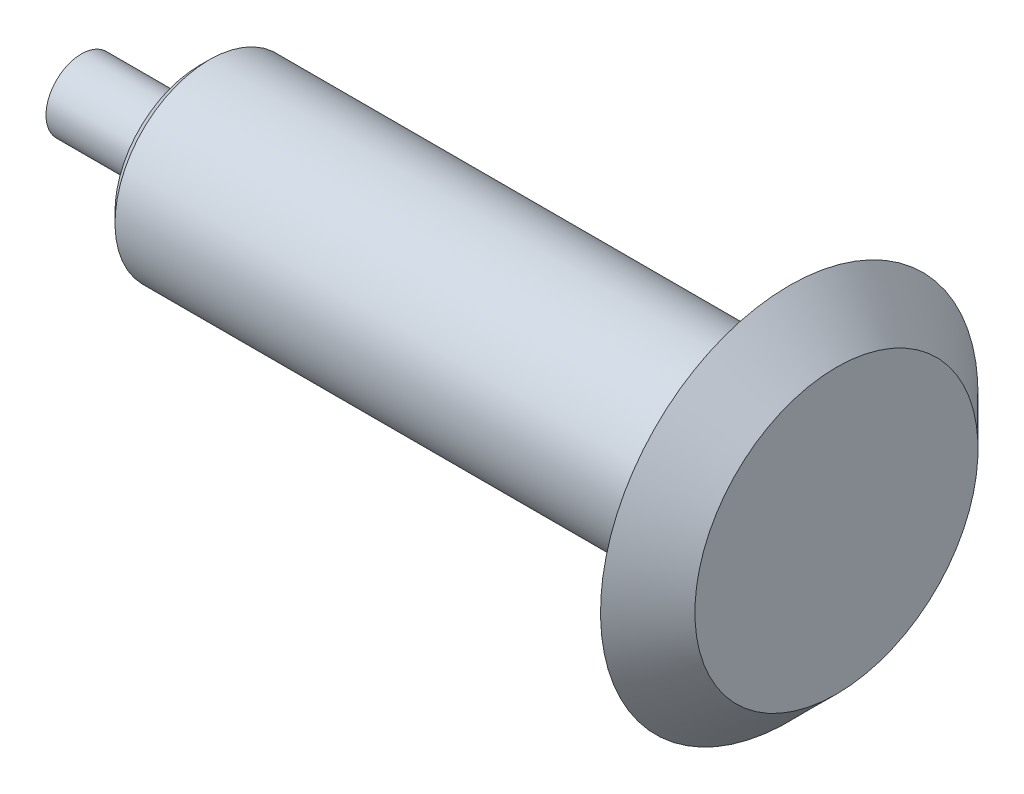
ISO-10303-21;
HEADER;
FILE_DESCRIPTION(('STEP AP214'),'2;1');
FILE_NAME('part.step','',(''),(''),'','','');
FILE_SCHEMA(('AUTOMOTIVE_DESIGN { 1 0 10303 214 1 1 1 1 }'));
ENDSEC;
DATA;
#1=APPLICATION_CONTEXT('core data for automotive mechanical design processes');
#2=APPLICATION_PROTOCOL_DEFINITION('international standard','automotive_design',2000,#1);
#3=PRODUCT_CONTEXT('',#1,'mechanical');
#4=PRODUCT('Part','Part','',(#3));
#5=PRODUCT_RELATED_PRODUCT_CATEGORY('part','',(#4));
#6=PRODUCT_DEFINITION_FORMATION('','',#4);
#7=PRODUCT_DEFINITION_CONTEXT('part definition',#1,'design');
#8=PRODUCT_DEFINITION('design','',#6,#7);
#9=PRODUCT_DEFINITION_SHAPE('','',#8);
#10=(LENGTH_UNIT() NAMED_UNIT(*) SI_UNIT(.MILLI.,.METRE.));
#11=(NAMED_UNIT(*) PLANE_ANGLE_UNIT() SI_UNIT($,.RADIAN.));
#12=(NAMED_UNIT(*) SI_UNIT($,.STERADIAN.) SOLID_ANGLE_UNIT());
#13=UNCERTAINTY_MEASURE_WITH_UNIT(LENGTH_MEASURE(1.E-05),#10,'distance_accuracy_value','');
#14=(GEOMETRIC_REPRESENTATION_CONTEXT(3) GLOBAL_UNCERTAINTY_ASSIGNED_CONTEXT((#13)) GLOBAL_UNIT_ASSIGNED_CONTEXT((#10,
#11,#12)) REPRESENTATION_CONTEXT('',''));
#15=CARTESIAN_POINT('',(0.,0.,0.));
#16=DIRECTION('',(0.,0.,1.));
#17=DIRECTION('',(1.,0.,0.));
#18=AXIS2_PLACEMENT_3D('',#15,#16,#17);
#19=CARTESIAN_POINT('',(0.,0.,0.));
#20=DIRECTION('',(-1.,0.,0.));
#21=DIRECTION('',(0.,-1.,0.));
#22=AXIS2_PLACEMENT_3D('',#19,#20,#21);
#23=PLANE('',#22);
#24=CARTESIAN_POINT('',(0.,0.,0.));
#25=DIRECTION('',(1.,0.,0.));
#26=DIRECTION('',(0.,1.,0.));
#27=AXIS2_PLACEMENT_3D('',#24,#25,#26);
#28=CIRCLE('',#27,7.5);
#29=CARTESIAN_POINT('',(0.,7.5,0.));
#30=VERTEX_POINT('',#29);
#31=EDGE_CURVE('E10',#30,#30,#28,.T.);
#32=ORIENTED_EDGE('',*,*,#31,.F.);
#33=EDGE_LOOP('',(#32));
#34=FACE_BOUND('',#33,.T.);
#35=ADVANCED_FACE('F39',(#34),#23,.T.);
#36=CARTESIAN_POINT('',(160.,0.,0.));
#37=DIRECTION('',(1.,0.,0.));
#38=DIRECTION('',(0.,1.,0.));
#39=AXIS2_PLACEMENT_3D('',#36,#37,#38);
#40=CYLINDRICAL_SURFACE('',#39,7.5);
#41=ORIENTED_EDGE('',*,*,#31,.T.);
#42=EDGE_LOOP('',(#41));
#43=FACE_BOUND('',#42,.T.);
#44=CARTESIAN_POINT('',(25.,0.,0.));
#45=DIRECTION('',(1.,0.,0.));
#46=DIRECTION('',(0.,1.,0.));
#47=AXIS2_PLACEMENT_3D('',#44,#45,#46);
#48=CIRCLE('',#47,7.5);
#49=CARTESIAN_POINT('',(25.,7.5,0.));
#50=VERTEX_POINT('',#49);
#51=EDGE_CURVE('E46',#50,#50,#48,.T.);
#52=ORIENTED_EDGE('',*,*,#51,.F.);
#53=EDGE_LOOP('',(#52));
#54=FACE_BOUND('',#53,.T.);
#55=ADVANCED_FACE('F95',(#43,#54),#40,.T.);
#56=CARTESIAN_POINT('',(25.,7.5,0.));
#57=DIRECTION('',(-1.,0.,0.));
#58=DIRECTION('',(0.,-1.,0.));
#59=AXIS2_PLACEMENT_3D('',#56,#57,#58);
#60=PLANE('',#59);
#61=ORIENTED_EDGE('',*,*,#51,.T.);
#62=EDGE_LOOP('',(#61));
#63=FACE_BOUND('',#62,.T.);
#64=CARTESIAN_POINT('',(25.,0.,0.));
#65=DIRECTION('',(1.,0.,0.));
#66=DIRECTION('',(0.,1.,0.));
#67=AXIS2_PLACEMENT_3D('',#64,#65,#66);
#68=CIRCLE('',#67,17.8786796564404);
#69=CARTESIAN_POINT('',(25.,17.8786796564404,0.));
#70=VERTEX_POINT('',#69);
#71=EDGE_CURVE('E51',#70,#70,#68,.T.);
#72=ORIENTED_EDGE('',*,*,#71,.F.);
#73=EDGE_LOOP('',(#72));
#74=FACE_BOUND('',#73,.T.);
#75=ADVANCED_FACE('F100',(#63,#74),#60,.T.);
#76=CARTESIAN_POINT('',(27.1213203435597,0.,0.));
#77=DIRECTION('',(1.,0.,0.));
#78=DIRECTION('',(0.,1.,0.));
#79=AXIS2_PLACEMENT_3D('',#76,#77,#78);
#80=CONICAL_SURFACE('',#79,20.,0.78539816339744);
#81=ORIENTED_EDGE('',*,*,#71,.T.);
#82=EDGE_LOOP('',(#81));
#83=FACE_BOUND('',#82,.T.);
#84=CARTESIAN_POINT('',(27.1213203435597,0.,0.));
#85=DIRECTION('',(1.,0.,0.));
#86=DIRECTION('',(0.,1.,0.));
#87=AXIS2_PLACEMENT_3D('',#84,#85,#86);
#88=CIRCLE('',#87,20.);
#89=CARTESIAN_POINT('',(27.1213203435597,20.,0.));
#90=VERTEX_POINT('',#89);
#91=EDGE_CURVE('E56',#90,#90,#88,.T.);
#92=ORIENTED_EDGE('',*,*,#91,.F.);
#93=EDGE_LOOP('',(#92));
#94=FACE_BOUND('',#93,.T.);
#95=ADVANCED_FACE('F104',(#83,#94),#80,.T.);
#96=CARTESIAN_POINT('',(160.,0.,0.));
#97=DIRECTION('',(1.,0.,0.));
#98=DIRECTION('',(0.,1.,0.));
#99=AXIS2_PLACEMENT_3D('',#96,#97,#98);
#100=CYLINDRICAL_SURFACE('',#99,20.);
#101=ORIENTED_EDGE('',*,*,#91,.T.);
#102=EDGE_LOOP('',(#101));
#103=FACE_BOUND('',#102,.T.);
#104=CARTESIAN_POINT('',(140.,0.,0.));
#105=DIRECTION('',(1.,0.,0.));
#106=DIRECTION('',(0.,1.,0.));
#107=AXIS2_PLACEMENT_3D('',#104,#105,#106);
#108=CIRCLE('',#107,20.);
#109=CARTESIAN_POINT('',(140.,20.,0.));
#110=VERTEX_POINT('',#109);
#111=EDGE_CURVE('E62',#110,#110,#108,.T.);
#112=ORIENTED_EDGE('',*,*,#111,.F.);
#113=EDGE_LOOP('',(#112));
#114=FACE_BOUND('',#113,.T.);
#115=ADVANCED_FACE('F110',(#103,#114),#100,.T.);
#116=CARTESIAN_POINT('',(150.,0.,0.));
#117=DIRECTION('',(1.,0.,0.));
#118=DIRECTION('',(0.,1.,0.));
#119=AXIS2_PLACEMENT_3D('',#116,#117,#118);
#120=CONICAL_SURFACE('',#119,30.0000000000001,0.785398163397451);
#121=ORIENTED_EDGE('',*,*,#111,.T.);
#122=EDGE_LOOP('',(#121));
#123=FACE_BOUND('',#122,.T.);
#124=CARTESIAN_POINT('',(150.,0.,0.));
#125=DIRECTION('',(1.,0.,0.));
#126=DIRECTION('',(0.,1.,0.));
#127=AXIS2_PLACEMENT_3D('',#124,#125,#126);
#128=CIRCLE('',#127,30.0000000000001);
#129=CARTESIAN_POINT('',(150.,30.0000000000001,0.));
#130=VERTEX_POINT('',#129);
#131=EDGE_CURVE('E66',#130,#130,#128,.T.);
#132=ORIENTED_EDGE('',*,*,#131,.F.);
#133=EDGE_LOOP('',(#132));
#134=FACE_BOUND('',#133,.T.);
#135=ADVANCED_FACE('F91',(#123,#134),#120,.T.);
#136=CARTESIAN_POINT('',(150.,30.0000000000001,0.));
#137=DIRECTION('',(-1.,0.,0.));
#138=DIRECTION('',(0.,-1.,0.));
#139=AXIS2_PLACEMENT_3D('',#136,#137,#138);
#140=PLANE('',#139);
#141=ORIENTED_EDGE('',*,*,#131,.T.);
#142=EDGE_LOOP('',(#141));
#143=FACE_BOUND('',#142,.T.);
#144=CARTESIAN_POINT('',(150.,0.,0.));
#145=DIRECTION('',(1.,0.,0.));
#146=DIRECTION('',(0.,1.,0.));
#147=AXIS2_PLACEMENT_3D('',#144,#145,#146);
#148=CIRCLE('',#147,40.);
#149=CARTESIAN_POINT('',(150.,40.,0.));
#150=VERTEX_POINT('',#149);
#151=EDGE_CURVE('E70',#150,#150,#148,.T.);
#152=ORIENTED_EDGE('',*,*,#151,.F.);
#153=EDGE_LOOP('',(#152));
#154=FACE_BOUND('',#153,.T.);
#155=ADVANCED_FACE('F83',(#143,#154),#140,.T.);
#156=CARTESIAN_POINT('',(160.,0.,0.));
#157=DIRECTION('',(-1.,0.,0.));
#158=DIRECTION('',(0.,-1.,0.));
#159=AXIS2_PLACEMENT_3D('',#156,#157,#158);
#160=CONICAL_SURFACE('',#159,30.,0.785398163397448);
#161=ORIENTED_EDGE('',*,*,#151,.T.);
#162=EDGE_LOOP('',(#161));
#163=FACE_BOUND('',#162,.T.);
#164=CARTESIAN_POINT('',(160.,0.,0.));
#165=DIRECTION('',(1.,0.,0.));
#166=DIRECTION('',(0.,1.,0.));
#167=AXIS2_PLACEMENT_3D('',#164,#165,#166);
#168=CIRCLE('',#167,30.);
#169=CARTESIAN_POINT('',(160.,30.,0.));
#170=VERTEX_POINT('',#169);
#171=EDGE_CURVE('E74',#170,#170,#168,.T.);
#172=ORIENTED_EDGE('',*,*,#171,.F.);
#173=EDGE_LOOP('',(#172));
#174=FACE_BOUND('',#173,.T.);
#175=ADVANCED_FACE('F81',(#163,#174),#160,.T.);
#176=CARTESIAN_POINT('',(160.,0.,0.));
#177=DIRECTION('',(1.,0.,0.));
#178=DIRECTION('',(0.,1.,0.));
#179=AXIS2_PLACEMENT_3D('',#176,#177,#178);
#180=PLANE('',#179);
#181=ORIENTED_EDGE('',*,*,#171,.T.);
#182=EDGE_LOOP('',(#181));
#183=FACE_BOUND('',#182,.T.);
#184=ADVANCED_FACE('F79',(#183),#180,.T.);
#185=CLOSED_SHELL('',(#35,#55,#75,#95,#115,#135,#155,#175,#184));
#186=MANIFOLD_SOLID_BREP('B2',#185);
#187=ADVANCED_BREP_SHAPE_REPRESENTATION('',(#18,#186),#14);
#188=SHAPE_DEFINITION_REPRESENTATION(#9,#187);
ENDSEC;
END-ISO-10303-21;
